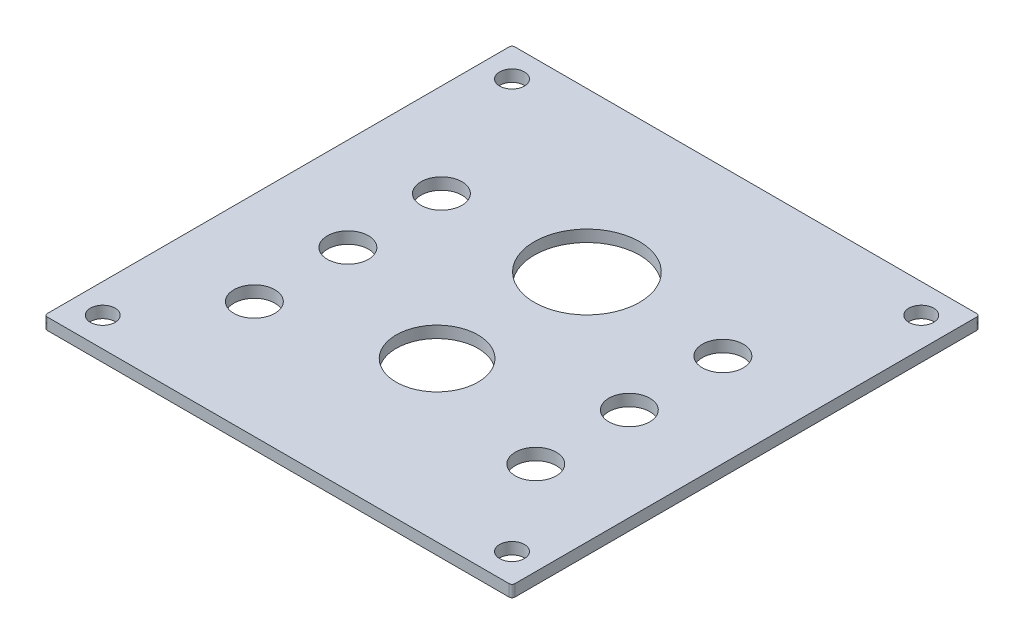
ISO-10303-21;
HEADER;
FILE_DESCRIPTION(('STEP AP214'),'2;1');
FILE_NAME('part.step','',(''),(''),'','','');
FILE_SCHEMA(('AUTOMOTIVE_DESIGN { 1 0 10303 214 1 1 1 1 }'));
ENDSEC;
DATA;
#1=APPLICATION_CONTEXT('core data for automotive mechanical design processes');
#2=APPLICATION_PROTOCOL_DEFINITION('international standard','automotive_design',2000,#1);
#3=PRODUCT_CONTEXT('',#1,'mechanical');
#4=PRODUCT('Part','Part','',(#3));
#5=PRODUCT_RELATED_PRODUCT_CATEGORY('part','',(#4));
#6=PRODUCT_DEFINITION_FORMATION('','',#4);
#7=PRODUCT_DEFINITION_CONTEXT('part definition',#1,'design');
#8=PRODUCT_DEFINITION('design','',#6,#7);
#9=PRODUCT_DEFINITION_SHAPE('','',#8);
#10=(LENGTH_UNIT() NAMED_UNIT(*) SI_UNIT(.MILLI.,.METRE.));
#11=(NAMED_UNIT(*) PLANE_ANGLE_UNIT() SI_UNIT($,.RADIAN.));
#12=(NAMED_UNIT(*) SI_UNIT($,.STERADIAN.) SOLID_ANGLE_UNIT());
#13=UNCERTAINTY_MEASURE_WITH_UNIT(LENGTH_MEASURE(1.E-05),#10,'distance_accuracy_value','');
#14=(GEOMETRIC_REPRESENTATION_CONTEXT(3) GLOBAL_UNCERTAINTY_ASSIGNED_CONTEXT((#13)) GLOBAL_UNIT_ASSIGNED_CONTEXT((#10,
#11,#12)) REPRESENTATION_CONTEXT('',''));
#15=CARTESIAN_POINT('',(0.,0.,0.));
#16=DIRECTION('',(0.,0.,1.));
#17=DIRECTION('',(1.,0.,0.));
#18=AXIS2_PLACEMENT_3D('',#15,#16,#17);
#19=CARTESIAN_POINT('',(76.3793482367759,0.,47.8960232997481));
#20=DIRECTION('',(0.,-1.,0.));
#21=DIRECTION('',(0.,0.,-1.));
#22=AXIS2_PLACEMENT_3D('',#19,#20,#21);
#23=CYLINDRICAL_SURFACE('',#22,0.793749999999989);
#24=CARTESIAN_POINT('',(76.3793482367759,0.,47.8960232997481));
#25=DIRECTION('',(0.,-1.,0.));
#26=DIRECTION('',(0.,0.,-1.));
#27=AXIS2_PLACEMENT_3D('',#24,#25,#26);
#28=CIRCLE('',#27,0.793749999999989);
#29=CARTESIAN_POINT('',(77.1730982367758,0.,47.8960232997481));
#30=VERTEX_POINT('',#29);
#31=CARTESIAN_POINT('',(76.3793482367759,0.,48.6897732997481));
#32=VERTEX_POINT('',#31);
#33=EDGE_CURVE('E92',#30,#32,#28,.T.);
#34=ORIENTED_EDGE('',*,*,#33,.T.);
#35=DIRECTION('',(0.,1.,0.));
#36=VECTOR('',#35,1.);
#37=CARTESIAN_POINT('',(76.3793482367759,0.,48.6897732997481));
#38=LINE('',#37,#36);
#39=CARTESIAN_POINT('',(76.3793482367759,-3.175,48.6897732997481));
#40=VERTEX_POINT('',#39);
#41=EDGE_CURVE('E127',#40,#32,#38,.T.);
#42=ORIENTED_EDGE('',*,*,#41,.F.);
#43=CARTESIAN_POINT('',(76.3793482367759,-3.175,47.8960232997481));
#44=DIRECTION('',(0.,-1.,0.));
#45=DIRECTION('',(0.,0.,-1.));
#46=AXIS2_PLACEMENT_3D('',#43,#44,#45);
#47=CIRCLE('',#46,0.793749999999989);
#48=CARTESIAN_POINT('',(77.1730982367758,-3.175,47.8960232997481));
#49=VERTEX_POINT('',#48);
#50=EDGE_CURVE('E27',#40,#49,#47,.F.);
#51=ORIENTED_EDGE('',*,*,#50,.T.);
#52=DIRECTION('',(0.,1.,0.));
#53=VECTOR('',#52,1.);
#54=CARTESIAN_POINT('',(77.1730982367758,0.,47.8960232997481));
#55=LINE('',#54,#53);
#56=EDGE_CURVE('E113',#30,#49,#55,.F.);
#57=ORIENTED_EDGE('',*,*,#56,.F.);
#58=EDGE_LOOP('',(#34,#42,#51,#57));
#59=FACE_BOUND('',#58,.T.);
#60=ADVANCED_FACE('F24',(#59),#23,.T.);
#61=CARTESIAN_POINT('',(-49.0331517632242,0.,47.8960232997481));
#62=DIRECTION('',(0.,-1.,0.));
#63=DIRECTION('',(0.,0.,-1.));
#64=AXIS2_PLACEMENT_3D('',#61,#62,#63);
#65=CYLINDRICAL_SURFACE('',#64,0.79375000000001);
#66=CARTESIAN_POINT('',(-49.0331517632242,0.,47.8960232997481));
#67=DIRECTION('',(0.,-1.,0.));
#68=DIRECTION('',(0.,0.,-1.));
#69=AXIS2_PLACEMENT_3D('',#66,#67,#68);
#70=CIRCLE('',#69,0.79375000000001);
#71=CARTESIAN_POINT('',(-49.0331517632242,0.,48.6897732997481));
#72=VERTEX_POINT('',#71);
#73=CARTESIAN_POINT('',(-49.8269017632242,0.,47.8960232997481));
#74=VERTEX_POINT('',#73);
#75=EDGE_CURVE('E209',#72,#74,#70,.T.);
#76=ORIENTED_EDGE('',*,*,#75,.T.);
#77=DIRECTION('',(0.,1.,0.));
#78=VECTOR('',#77,1.);
#79=CARTESIAN_POINT('',(-49.8269017632242,0.,47.8960232997481));
#80=LINE('',#79,#78);
#81=CARTESIAN_POINT('',(-49.8269017632242,-3.175,47.8960232997481));
#82=VERTEX_POINT('',#81);
#83=EDGE_CURVE('E135',#82,#74,#80,.T.);
#84=ORIENTED_EDGE('',*,*,#83,.F.);
#85=CARTESIAN_POINT('',(-49.0331517632242,-3.175,47.8960232997481));
#86=DIRECTION('',(0.,-1.,0.));
#87=DIRECTION('',(0.,0.,-1.));
#88=AXIS2_PLACEMENT_3D('',#85,#86,#87);
#89=CIRCLE('',#88,0.79375000000001);
#90=CARTESIAN_POINT('',(-49.0331517632242,-3.175,48.6897732997481));
#91=VERTEX_POINT('',#90);
#92=EDGE_CURVE('E212',#82,#91,#89,.F.);
#93=ORIENTED_EDGE('',*,*,#92,.T.);
#94=DIRECTION('',(0.,1.,0.));
#95=VECTOR('',#94,1.);
#96=CARTESIAN_POINT('',(-49.0331517632242,0.,48.6897732997481));
#97=LINE('',#96,#95);
#98=EDGE_CURVE('E124',#72,#91,#97,.F.);
#99=ORIENTED_EDGE('',*,*,#98,.F.);
#100=EDGE_LOOP('',(#76,#84,#93,#99));
#101=FACE_BOUND('',#100,.T.);
#102=ADVANCED_FACE('F217',(#101),#65,.T.);
#103=CARTESIAN_POINT('',(-49.0331517632242,0.,-77.5164767002519));
#104=DIRECTION('',(0.,-1.,0.));
#105=DIRECTION('',(0.,0.,-1.));
#106=AXIS2_PLACEMENT_3D('',#103,#104,#105);
#107=CYLINDRICAL_SURFACE('',#106,0.793749999999996);
#108=CARTESIAN_POINT('',(-49.0331517632242,0.,-77.5164767002519));
#109=DIRECTION('',(0.,-1.,0.));
#110=DIRECTION('',(0.,0.,-1.));
#111=AXIS2_PLACEMENT_3D('',#108,#109,#110);
#112=CIRCLE('',#111,0.793749999999996);
#113=CARTESIAN_POINT('',(-49.8269017632242,0.,-77.5164767002519));
#114=VERTEX_POINT('',#113);
#115=CARTESIAN_POINT('',(-49.0331517632242,0.,-78.3102267002519));
#116=VERTEX_POINT('',#115);
#117=EDGE_CURVE('E207',#114,#116,#112,.T.);
#118=ORIENTED_EDGE('',*,*,#117,.T.);
#119=DIRECTION('',(0.,1.,0.));
#120=VECTOR('',#119,1.);
#121=CARTESIAN_POINT('',(-49.0331517632242,0.,-78.3102267002519));
#122=LINE('',#121,#120);
#123=CARTESIAN_POINT('',(-49.0331517632242,-3.175,-78.3102267002519));
#124=VERTEX_POINT('',#123);
#125=EDGE_CURVE('E130',#124,#116,#122,.T.);
#126=ORIENTED_EDGE('',*,*,#125,.F.);
#127=CARTESIAN_POINT('',(-49.0331517632242,-3.175,-77.5164767002519));
#128=DIRECTION('',(0.,-1.,0.));
#129=DIRECTION('',(0.,0.,-1.));
#130=AXIS2_PLACEMENT_3D('',#127,#128,#129);
#131=CIRCLE('',#130,0.793749999999996);
#132=CARTESIAN_POINT('',(-49.8269017632242,-3.175,-77.5164767002519));
#133=VERTEX_POINT('',#132);
#134=EDGE_CURVE('E41',#124,#133,#131,.F.);
#135=ORIENTED_EDGE('',*,*,#134,.T.);
#136=DIRECTION('',(0.,1.,0.));
#137=VECTOR('',#136,1.);
#138=CARTESIAN_POINT('',(-49.8269017632242,0.,-77.5164767002519));
#139=LINE('',#138,#137);
#140=EDGE_CURVE('E134',#114,#133,#139,.F.);
#141=ORIENTED_EDGE('',*,*,#140,.F.);
#142=EDGE_LOOP('',(#118,#126,#135,#141));
#143=FACE_BOUND('',#142,.T.);
#144=ADVANCED_FACE('F241',(#143),#107,.T.);
#145=CARTESIAN_POINT('',(76.3793482367759,0.,-77.5164767002519));
#146=DIRECTION('',(0.,-1.,0.));
#147=DIRECTION('',(0.,0.,-1.));
#148=AXIS2_PLACEMENT_3D('',#145,#146,#147);
#149=PLANE('',#148);
#150=DIRECTION('',(-1.,0.,0.));
#151=VECTOR('',#150,1.);
#152=CARTESIAN_POINT('',(-49.0331517632242,0.,-78.3102267002519));
#153=LINE('',#152,#151);
#154=CARTESIAN_POINT('',(76.3793482367759,0.,-78.3102267002519));
#155=VERTEX_POINT('',#154);
#156=EDGE_CURVE('E128',#116,#155,#153,.F.);
#157=ORIENTED_EDGE('',*,*,#156,.F.);
#158=ORIENTED_EDGE('',*,*,#117,.F.);
#159=DIRECTION('',(0.,0.,1.));
#160=VECTOR('',#159,1.);
#161=CARTESIAN_POINT('',(-49.8269017632242,0.,47.8960232997481));
#162=LINE('',#161,#160);
#163=EDGE_CURVE('E131',#74,#114,#162,.F.);
#164=ORIENTED_EDGE('',*,*,#163,.F.);
#165=ORIENTED_EDGE('',*,*,#75,.F.);
#166=DIRECTION('',(1.,0.,0.));
#167=VECTOR('',#166,1.);
#168=CARTESIAN_POINT('',(76.3793482367759,0.,48.6897732997481));
#169=LINE('',#168,#167);
#170=EDGE_CURVE('E136',#32,#72,#169,.F.);
#171=ORIENTED_EDGE('',*,*,#170,.F.);
#172=ORIENTED_EDGE('',*,*,#33,.F.);
#173=DIRECTION('',(0.,0.,-1.));
#174=VECTOR('',#173,1.);
#175=CARTESIAN_POINT('',(77.1730982367758,0.,-77.5164767002519));
#176=LINE('',#175,#174);
#177=CARTESIAN_POINT('',(77.1730982367758,0.,-77.5164767002519));
#178=VERTEX_POINT('',#177);
#179=EDGE_CURVE('E109',#178,#30,#176,.F.);
#180=ORIENTED_EDGE('',*,*,#179,.F.);
#181=CARTESIAN_POINT('',(76.3793482367759,0.,-77.5164767002519));
#182=DIRECTION('',(0.,-1.,0.));
#183=DIRECTION('',(0.,0.,-1.));
#184=AXIS2_PLACEMENT_3D('',#181,#182,#183);
#185=CIRCLE('',#184,0.793749999999996);
#186=EDGE_CURVE('E97',#155,#178,#185,.T.);
#187=ORIENTED_EDGE('',*,*,#186,.F.);
#188=EDGE_LOOP('',(#157,#158,#164,#165,#171,#172,#180,#187));
#189=FACE_BOUND('',#188,.T.);
#190=CARTESIAN_POINT('',(-24.5351467305084,0.,-33.8602267002519));
#191=DIRECTION('',(0.,-1.,0.));
#192=DIRECTION('',(0.,0.,-1.));
#193=AXIS2_PLACEMENT_3D('',#190,#191,#192);
#194=CIRCLE('',#193,5.5626);
#195=CARTESIAN_POINT('',(-24.5351467305084,0.,-39.4228267002519));
#196=VERTEX_POINT('',#195);
#197=EDGE_CURVE('E117',#196,#196,#194,.T.);
#198=ORIENTED_EDGE('',*,*,#197,.T.);
#199=EDGE_LOOP('',(#198));
#200=FACE_BOUND('',#199,.T.);
#201=CARTESIAN_POINT('',(51.88134320406,0.,16.9397732997481));
#202=DIRECTION('',(0.,-1.,0.));
#203=DIRECTION('',(0.,0.,-1.));
#204=AXIS2_PLACEMENT_3D('',#201,#202,#203);
#205=CIRCLE('',#204,5.5626);
#206=CARTESIAN_POINT('',(51.88134320406,0.,11.3771732997481));
#207=VERTEX_POINT('',#206);
#208=EDGE_CURVE('E120',#207,#207,#205,.T.);
#209=ORIENTED_EDGE('',*,*,#208,.T.);
#210=EDGE_LOOP('',(#209));
#211=FACE_BOUND('',#210,.T.);
#212=CARTESIAN_POINT('',(-24.5351467305084,0.,-8.4602267002519));
#213=DIRECTION('',(0.,-1.,0.));
#214=DIRECTION('',(0.,0.,-1.));
#215=AXIS2_PLACEMENT_3D('',#212,#213,#214);
#216=CIRCLE('',#215,5.5626);
#217=CARTESIAN_POINT('',(-24.5351467305084,0.,-14.0228267002519));
#218=VERTEX_POINT('',#217);
#219=EDGE_CURVE('E177',#218,#218,#216,.T.);
#220=ORIENTED_EDGE('',*,*,#219,.T.);
#221=EDGE_LOOP('',(#220));
#222=FACE_BOUND('',#221,.T.);
#223=CARTESIAN_POINT('',(13.6730982367758,0.,-35.1556267002519));
#224=DIRECTION('',(0.,-1.,0.));
#225=DIRECTION('',(0.,0.,-1.));
#226=AXIS2_PLACEMENT_3D('',#223,#224,#225);
#227=CIRCLE('',#226,14.2875);
#228=CARTESIAN_POINT('',(13.6730982367758,0.,-49.4431267002519));
#229=VERTEX_POINT('',#228);
#230=EDGE_CURVE('E180',#229,#229,#227,.T.);
#231=ORIENTED_EDGE('',*,*,#230,.T.);
#232=EDGE_LOOP('',(#231));
#233=FACE_BOUND('',#232,.T.);
#234=CARTESIAN_POINT('',(-41.8894017632242,0.,-70.3727267002519));
#235=DIRECTION('',(0.,-1.,0.));
#236=DIRECTION('',(0.,0.,-1.));
#237=AXIS2_PLACEMENT_3D('',#234,#235,#236);
#238=CIRCLE('',#237,3.3528);
#239=CARTESIAN_POINT('',(-41.8894017632242,0.,-73.7255267002519));
#240=VERTEX_POINT('',#239);
#241=EDGE_CURVE('E183',#240,#240,#238,.T.);
#242=ORIENTED_EDGE('',*,*,#241,.T.);
#243=EDGE_LOOP('',(#242));
#244=FACE_BOUND('',#243,.T.);
#245=CARTESIAN_POINT('',(69.2355982367758,0.,40.7522732997481));
#246=DIRECTION('',(0.,-1.,0.));
#247=DIRECTION('',(0.,0.,-1.));
#248=AXIS2_PLACEMENT_3D('',#245,#246,#247);
#249=CIRCLE('',#248,3.3528);
#250=CARTESIAN_POINT('',(69.2355982367758,0.,37.3994732997481));
#251=VERTEX_POINT('',#250);
#252=EDGE_CURVE('E186',#251,#251,#249,.T.);
#253=ORIENTED_EDGE('',*,*,#252,.T.);
#254=EDGE_LOOP('',(#253));
#255=FACE_BOUND('',#254,.T.);
#256=CARTESIAN_POINT('',(69.2355982367759,0.,-70.3727267002519));
#257=DIRECTION('',(0.,-1.,0.));
#258=DIRECTION('',(0.,0.,-1.));
#259=AXIS2_PLACEMENT_3D('',#256,#257,#258);
#260=CIRCLE('',#259,3.3528);
#261=CARTESIAN_POINT('',(69.2355982367759,0.,-73.7255267002519));
#262=VERTEX_POINT('',#261);
#263=EDGE_CURVE('E189',#262,#262,#260,.T.);
#264=ORIENTED_EDGE('',*,*,#263,.T.);
#265=EDGE_LOOP('',(#264));
#266=FACE_BOUND('',#265,.T.);
#267=CARTESIAN_POINT('',(13.6730982367758,0.,5.53517329974811));
#268=DIRECTION('',(0.,-1.,0.));
#269=DIRECTION('',(0.,0.,-1.));
#270=AXIS2_PLACEMENT_3D('',#267,#268,#269);
#271=CIRCLE('',#270,11.1125);
#272=CARTESIAN_POINT('',(13.6730982367758,0.,-5.57732670025189));
#273=VERTEX_POINT('',#272);
#274=EDGE_CURVE('E192',#273,#273,#271,.T.);
#275=ORIENTED_EDGE('',*,*,#274,.T.);
#276=EDGE_LOOP('',(#275));
#277=FACE_BOUND('',#276,.T.);
#278=CARTESIAN_POINT('',(-41.8894017632242,0.,40.7522732997481));
#279=DIRECTION('',(0.,-1.,0.));
#280=DIRECTION('',(0.,0.,-1.));
#281=AXIS2_PLACEMENT_3D('',#278,#279,#280);
#282=CIRCLE('',#281,3.3528);
#283=CARTESIAN_POINT('',(-41.8894017632242,0.,37.3994732997481));
#284=VERTEX_POINT('',#283);
#285=EDGE_CURVE('E195',#284,#284,#282,.T.);
#286=ORIENTED_EDGE('',*,*,#285,.T.);
#287=EDGE_LOOP('',(#286));
#288=FACE_BOUND('',#287,.T.);
#289=CARTESIAN_POINT('',(-24.5351467305084,0.,16.9397732997481));
#290=DIRECTION('',(0.,-1.,0.));
#291=DIRECTION('',(0.,0.,-1.));
#292=AXIS2_PLACEMENT_3D('',#289,#290,#291);
#293=CIRCLE('',#292,5.5626);
#294=CARTESIAN_POINT('',(-24.5351467305084,0.,11.3771732997481));
#295=VERTEX_POINT('',#294);
#296=EDGE_CURVE('E198',#295,#295,#293,.T.);
#297=ORIENTED_EDGE('',*,*,#296,.T.);
#298=EDGE_LOOP('',(#297));
#299=FACE_BOUND('',#298,.T.);
#300=CARTESIAN_POINT('',(51.8813432040601,0.,-33.8602267002519));
#301=DIRECTION('',(0.,-1.,0.));
#302=DIRECTION('',(0.,0.,-1.));
#303=AXIS2_PLACEMENT_3D('',#300,#301,#302);
#304=CIRCLE('',#303,5.5626);
#305=CARTESIAN_POINT('',(51.8813432040601,0.,-39.4228267002519));
#306=VERTEX_POINT('',#305);
#307=EDGE_CURVE('E201',#306,#306,#304,.T.);
#308=ORIENTED_EDGE('',*,*,#307,.T.);
#309=EDGE_LOOP('',(#308));
#310=FACE_BOUND('',#309,.T.);
#311=CARTESIAN_POINT('',(51.8813432040601,0.,-8.4602267002519));
#312=DIRECTION('',(0.,-1.,0.));
#313=DIRECTION('',(0.,0.,-1.));
#314=AXIS2_PLACEMENT_3D('',#311,#312,#313);
#315=CIRCLE('',#314,5.5626);
#316=CARTESIAN_POINT('',(51.8813432040601,0.,-14.0228267002519));
#317=VERTEX_POINT('',#316);
#318=EDGE_CURVE('E106',#317,#317,#315,.T.);
#319=ORIENTED_EDGE('',*,*,#318,.T.);
#320=EDGE_LOOP('',(#319));
#321=FACE_BOUND('',#320,.T.);
#322=ADVANCED_FACE('F110',(#189,#200,#211,#222,#233,#244,#255,#266,#277,#288,#299,#310,#321),
#149,.F.);
#323=CARTESIAN_POINT('',(76.3793482367759,0.,-77.5164767002519));
#324=DIRECTION('',(0.,-1.,0.));
#325=DIRECTION('',(0.,0.,-1.));
#326=AXIS2_PLACEMENT_3D('',#323,#324,#325);
#327=CYLINDRICAL_SURFACE('',#326,0.793749999999996);
#328=ORIENTED_EDGE('',*,*,#186,.T.);
#329=DIRECTION('',(0.,1.,0.));
#330=VECTOR('',#329,1.);
#331=CARTESIAN_POINT('',(77.1730982367758,0.,-77.5164767002519));
#332=LINE('',#331,#330);
#333=CARTESIAN_POINT('',(77.1730982367758,-3.175,-77.5164767002519));
#334=VERTEX_POINT('',#333);
#335=EDGE_CURVE('E100',#334,#178,#332,.T.);
#336=ORIENTED_EDGE('',*,*,#335,.F.);
#337=CARTESIAN_POINT('',(76.3793482367759,-3.175,-77.5164767002519));
#338=DIRECTION('',(0.,-1.,0.));
#339=DIRECTION('',(0.,0.,-1.));
#340=AXIS2_PLACEMENT_3D('',#337,#338,#339);
#341=CIRCLE('',#340,0.793749999999996);
#342=CARTESIAN_POINT('',(76.3793482367759,-3.175,-78.3102267002519));
#343=VERTEX_POINT('',#342);
#344=EDGE_CURVE('E67',#334,#343,#341,.F.);
#345=ORIENTED_EDGE('',*,*,#344,.T.);
#346=DIRECTION('',(0.,1.,0.));
#347=VECTOR('',#346,1.);
#348=CARTESIAN_POINT('',(76.3793482367759,0.,-78.3102267002519));
#349=LINE('',#348,#347);
#350=EDGE_CURVE('E103',#155,#343,#349,.F.);
#351=ORIENTED_EDGE('',*,*,#350,.F.);
#352=EDGE_LOOP('',(#328,#336,#345,#351));
#353=FACE_BOUND('',#352,.T.);
#354=ADVANCED_FACE('F98',(#353),#327,.T.);
#355=CARTESIAN_POINT('',(51.8813432040601,0.,-8.4602267002519));
#356=DIRECTION('',(0.,-1.,0.));
#357=DIRECTION('',(0.,0.,-1.));
#358=AXIS2_PLACEMENT_3D('',#355,#356,#357);
#359=CYLINDRICAL_SURFACE('',#358,5.5626);
#360=CARTESIAN_POINT('',(51.8813432040601,-3.175,-8.4602267002519));
#361=DIRECTION('',(0.,-1.,0.));
#362=DIRECTION('',(0.,0.,-1.));
#363=AXIS2_PLACEMENT_3D('',#360,#361,#362);
#364=CIRCLE('',#363,5.5626);
#365=CARTESIAN_POINT('',(51.8813432040601,-3.175,-14.0228267002519));
#366=VERTEX_POINT('',#365);
#367=EDGE_CURVE('E172',#366,#366,#364,.F.);
#368=ORIENTED_EDGE('',*,*,#367,.F.);
#369=EDGE_LOOP('',(#368));
#370=FACE_BOUND('',#369,.T.);
#371=ORIENTED_EDGE('',*,*,#318,.F.);
#372=EDGE_LOOP('',(#371));
#373=FACE_BOUND('',#372,.T.);
#374=ADVANCED_FACE('F302',(#370,#373),#359,.F.);
#375=CARTESIAN_POINT('',(51.8813432040601,0.,-33.8602267002519));
#376=DIRECTION('',(0.,-1.,0.));
#377=DIRECTION('',(0.,0.,-1.));
#378=AXIS2_PLACEMENT_3D('',#375,#376,#377);
#379=CYLINDRICAL_SURFACE('',#378,5.5626);
#380=CARTESIAN_POINT('',(51.8813432040601,-3.175,-33.8602267002519));
#381=DIRECTION('',(0.,-1.,0.));
#382=DIRECTION('',(0.,0.,-1.));
#383=AXIS2_PLACEMENT_3D('',#380,#381,#382);
#384=CIRCLE('',#383,5.5626);
#385=CARTESIAN_POINT('',(51.8813432040601,-3.175,-39.4228267002519));
#386=VERTEX_POINT('',#385);
#387=EDGE_CURVE('E169',#386,#386,#384,.F.);
#388=ORIENTED_EDGE('',*,*,#387,.F.);
#389=EDGE_LOOP('',(#388));
#390=FACE_BOUND('',#389,.T.);
#391=ORIENTED_EDGE('',*,*,#307,.F.);
#392=EDGE_LOOP('',(#391));
#393=FACE_BOUND('',#392,.T.);
#394=ADVANCED_FACE('F298',(#390,#393),#379,.F.);
#395=CARTESIAN_POINT('',(-24.5351467305084,0.,16.9397732997481));
#396=DIRECTION('',(0.,-1.,0.));
#397=DIRECTION('',(0.,0.,-1.));
#398=AXIS2_PLACEMENT_3D('',#395,#396,#397);
#399=CYLINDRICAL_SURFACE('',#398,5.5626);
#400=CARTESIAN_POINT('',(-24.5351467305084,-3.175,16.9397732997481));
#401=DIRECTION('',(0.,-1.,0.));
#402=DIRECTION('',(0.,0.,-1.));
#403=AXIS2_PLACEMENT_3D('',#400,#401,#402);
#404=CIRCLE('',#403,5.5626);
#405=CARTESIAN_POINT('',(-24.5351467305084,-3.175,11.3771732997481));
#406=VERTEX_POINT('',#405);
#407=EDGE_CURVE('E166',#406,#406,#404,.F.);
#408=ORIENTED_EDGE('',*,*,#407,.F.);
#409=EDGE_LOOP('',(#408));
#410=FACE_BOUND('',#409,.T.);
#411=ORIENTED_EDGE('',*,*,#296,.F.);
#412=EDGE_LOOP('',(#411));
#413=FACE_BOUND('',#412,.T.);
#414=ADVANCED_FACE('F294',(#410,#413),#399,.F.);
#415=CARTESIAN_POINT('',(-41.8894017632242,0.,40.7522732997481));
#416=DIRECTION('',(0.,-1.,0.));
#417=DIRECTION('',(0.,0.,-1.));
#418=AXIS2_PLACEMENT_3D('',#415,#416,#417);
#419=CYLINDRICAL_SURFACE('',#418,3.3528);
#420=CARTESIAN_POINT('',(-41.8894017632242,-3.175,40.7522732997481));
#421=DIRECTION('',(0.,-1.,0.));
#422=DIRECTION('',(0.,0.,-1.));
#423=AXIS2_PLACEMENT_3D('',#420,#421,#422);
#424=CIRCLE('',#423,3.3528);
#425=CARTESIAN_POINT('',(-41.8894017632242,-3.175,37.3994732997481));
#426=VERTEX_POINT('',#425);
#427=EDGE_CURVE('E163',#426,#426,#424,.F.);
#428=ORIENTED_EDGE('',*,*,#427,.F.);
#429=EDGE_LOOP('',(#428));
#430=FACE_BOUND('',#429,.T.);
#431=ORIENTED_EDGE('',*,*,#285,.F.);
#432=EDGE_LOOP('',(#431));
#433=FACE_BOUND('',#432,.T.);
#434=ADVANCED_FACE('F290',(#430,#433),#419,.F.);
#435=CARTESIAN_POINT('',(13.6730982367758,0.,5.53517329974811));
#436=DIRECTION('',(0.,-1.,0.));
#437=DIRECTION('',(0.,0.,-1.));
#438=AXIS2_PLACEMENT_3D('',#435,#436,#437);
#439=CYLINDRICAL_SURFACE('',#438,11.1125);
#440=CARTESIAN_POINT('',(13.6730982367758,-3.175,5.53517329974811));
#441=DIRECTION('',(0.,-1.,0.));
#442=DIRECTION('',(0.,0.,-1.));
#443=AXIS2_PLACEMENT_3D('',#440,#441,#442);
#444=CIRCLE('',#443,11.1125);
#445=CARTESIAN_POINT('',(13.6730982367758,-3.175,-5.57732670025189));
#446=VERTEX_POINT('',#445);
#447=EDGE_CURVE('E160',#446,#446,#444,.F.);
#448=ORIENTED_EDGE('',*,*,#447,.F.);
#449=EDGE_LOOP('',(#448));
#450=FACE_BOUND('',#449,.T.);
#451=ORIENTED_EDGE('',*,*,#274,.F.);
#452=EDGE_LOOP('',(#451));
#453=FACE_BOUND('',#452,.T.);
#454=ADVANCED_FACE('F286',(#450,#453),#439,.F.);
#455=CARTESIAN_POINT('',(69.2355982367759,0.,-70.3727267002519));
#456=DIRECTION('',(0.,-1.,0.));
#457=DIRECTION('',(0.,0.,-1.));
#458=AXIS2_PLACEMENT_3D('',#455,#456,#457);
#459=CYLINDRICAL_SURFACE('',#458,3.3528);
#460=CARTESIAN_POINT('',(69.2355982367759,-3.175,-70.3727267002519));
#461=DIRECTION('',(0.,-1.,0.));
#462=DIRECTION('',(0.,0.,-1.));
#463=AXIS2_PLACEMENT_3D('',#460,#461,#462);
#464=CIRCLE('',#463,3.3528);
#465=CARTESIAN_POINT('',(69.2355982367759,-3.175,-73.7255267002519));
#466=VERTEX_POINT('',#465);
#467=EDGE_CURVE('E157',#466,#466,#464,.F.);
#468=ORIENTED_EDGE('',*,*,#467,.F.);
#469=EDGE_LOOP('',(#468));
#470=FACE_BOUND('',#469,.T.);
#471=ORIENTED_EDGE('',*,*,#263,.F.);
#472=EDGE_LOOP('',(#471));
#473=FACE_BOUND('',#472,.T.);
#474=ADVANCED_FACE('F282',(#470,#473),#459,.F.);
#475=CARTESIAN_POINT('',(69.2355982367758,0.,40.7522732997481));
#476=DIRECTION('',(0.,-1.,0.));
#477=DIRECTION('',(0.,0.,-1.));
#478=AXIS2_PLACEMENT_3D('',#475,#476,#477);
#479=CYLINDRICAL_SURFACE('',#478,3.3528);
#480=CARTESIAN_POINT('',(69.2355982367758,-3.175,40.7522732997481));
#481=DIRECTION('',(0.,-1.,0.));
#482=DIRECTION('',(0.,0.,-1.));
#483=AXIS2_PLACEMENT_3D('',#480,#481,#482);
#484=CIRCLE('',#483,3.3528);
#485=CARTESIAN_POINT('',(69.2355982367758,-3.175,37.3994732997481));
#486=VERTEX_POINT('',#485);
#487=EDGE_CURVE('E154',#486,#486,#484,.F.);
#488=ORIENTED_EDGE('',*,*,#487,.F.);
#489=EDGE_LOOP('',(#488));
#490=FACE_BOUND('',#489,.T.);
#491=ORIENTED_EDGE('',*,*,#252,.F.);
#492=EDGE_LOOP('',(#491));
#493=FACE_BOUND('',#492,.T.);
#494=ADVANCED_FACE('F278',(#490,#493),#479,.F.);
#495=CARTESIAN_POINT('',(-41.8894017632242,0.,-70.3727267002519));
#496=DIRECTION('',(0.,-1.,0.));
#497=DIRECTION('',(0.,0.,-1.));
#498=AXIS2_PLACEMENT_3D('',#495,#496,#497);
#499=CYLINDRICAL_SURFACE('',#498,3.3528);
#500=CARTESIAN_POINT('',(-41.8894017632242,-3.175,-70.3727267002519));
#501=DIRECTION('',(0.,-1.,0.));
#502=DIRECTION('',(0.,0.,-1.));
#503=AXIS2_PLACEMENT_3D('',#500,#501,#502);
#504=CIRCLE('',#503,3.3528);
#505=CARTESIAN_POINT('',(-41.8894017632242,-3.175,-73.7255267002519));
#506=VERTEX_POINT('',#505);
#507=EDGE_CURVE('E151',#506,#506,#504,.F.);
#508=ORIENTED_EDGE('',*,*,#507,.F.);
#509=EDGE_LOOP('',(#508));
#510=FACE_BOUND('',#509,.T.);
#511=ORIENTED_EDGE('',*,*,#241,.F.);
#512=EDGE_LOOP('',(#511));
#513=FACE_BOUND('',#512,.T.);
#514=ADVANCED_FACE('F274',(#510,#513),#499,.F.);
#515=CARTESIAN_POINT('',(13.6730982367758,0.,-35.1556267002519));
#516=DIRECTION('',(0.,-1.,0.));
#517=DIRECTION('',(0.,0.,-1.));
#518=AXIS2_PLACEMENT_3D('',#515,#516,#517);
#519=CYLINDRICAL_SURFACE('',#518,14.2875);
#520=CARTESIAN_POINT('',(13.6730982367758,-3.175,-35.1556267002519));
#521=DIRECTION('',(0.,-1.,0.));
#522=DIRECTION('',(0.,0.,-1.));
#523=AXIS2_PLACEMENT_3D('',#520,#521,#522);
#524=CIRCLE('',#523,14.2875);
#525=CARTESIAN_POINT('',(13.6730982367758,-3.175,-49.4431267002519));
#526=VERTEX_POINT('',#525);
#527=EDGE_CURVE('E148',#526,#526,#524,.F.);
#528=ORIENTED_EDGE('',*,*,#527,.F.);
#529=EDGE_LOOP('',(#528));
#530=FACE_BOUND('',#529,.T.);
#531=ORIENTED_EDGE('',*,*,#230,.F.);
#532=EDGE_LOOP('',(#531));
#533=FACE_BOUND('',#532,.T.);
#534=ADVANCED_FACE('F270',(#530,#533),#519,.F.);
#535=CARTESIAN_POINT('',(-24.5351467305084,0.,-8.4602267002519));
#536=DIRECTION('',(0.,-1.,0.));
#537=DIRECTION('',(0.,0.,-1.));
#538=AXIS2_PLACEMENT_3D('',#535,#536,#537);
#539=CYLINDRICAL_SURFACE('',#538,5.5626);
#540=CARTESIAN_POINT('',(-24.5351467305084,-3.175,-8.4602267002519));
#541=DIRECTION('',(0.,-1.,0.));
#542=DIRECTION('',(0.,0.,-1.));
#543=AXIS2_PLACEMENT_3D('',#540,#541,#542);
#544=CIRCLE('',#543,5.5626);
#545=CARTESIAN_POINT('',(-24.5351467305084,-3.175,-14.0228267002519));
#546=VERTEX_POINT('',#545);
#547=EDGE_CURVE('E145',#546,#546,#544,.F.);
#548=ORIENTED_EDGE('',*,*,#547,.F.);
#549=EDGE_LOOP('',(#548));
#550=FACE_BOUND('',#549,.T.);
#551=ORIENTED_EDGE('',*,*,#219,.F.);
#552=EDGE_LOOP('',(#551));
#553=FACE_BOUND('',#552,.T.);
#554=ADVANCED_FACE('F266',(#550,#553),#539,.F.);
#555=CARTESIAN_POINT('',(51.88134320406,0.,16.9397732997481));
#556=DIRECTION('',(0.,-1.,0.));
#557=DIRECTION('',(0.,0.,-1.));
#558=AXIS2_PLACEMENT_3D('',#555,#556,#557);
#559=CYLINDRICAL_SURFACE('',#558,5.5626);
#560=CARTESIAN_POINT('',(51.88134320406,-3.175,16.9397732997481));
#561=DIRECTION('',(0.,-1.,0.));
#562=DIRECTION('',(0.,0.,-1.));
#563=AXIS2_PLACEMENT_3D('',#560,#561,#562);
#564=CIRCLE('',#563,5.5626);
#565=CARTESIAN_POINT('',(51.88134320406,-3.175,11.3771732997481));
#566=VERTEX_POINT('',#565);
#567=EDGE_CURVE('E142',#566,#566,#564,.F.);
#568=ORIENTED_EDGE('',*,*,#567,.F.);
#569=EDGE_LOOP('',(#568));
#570=FACE_BOUND('',#569,.T.);
#571=ORIENTED_EDGE('',*,*,#208,.F.);
#572=EDGE_LOOP('',(#571));
#573=FACE_BOUND('',#572,.T.);
#574=ADVANCED_FACE('F262',(#570,#573),#559,.F.);
#575=CARTESIAN_POINT('',(-24.5351467305084,0.,-33.8602267002519));
#576=DIRECTION('',(0.,-1.,0.));
#577=DIRECTION('',(0.,0.,-1.));
#578=AXIS2_PLACEMENT_3D('',#575,#576,#577);
#579=CYLINDRICAL_SURFACE('',#578,5.5626);
#580=CARTESIAN_POINT('',(-24.5351467305084,-3.175,-33.8602267002519));
#581=DIRECTION('',(0.,-1.,0.));
#582=DIRECTION('',(0.,0.,-1.));
#583=AXIS2_PLACEMENT_3D('',#580,#581,#582);
#584=CIRCLE('',#583,5.5626);
#585=CARTESIAN_POINT('',(-24.5351467305084,-3.175,-39.4228267002519));
#586=VERTEX_POINT('',#585);
#587=EDGE_CURVE('E139',#586,#586,#584,.F.);
#588=ORIENTED_EDGE('',*,*,#587,.F.);
#589=EDGE_LOOP('',(#588));
#590=FACE_BOUND('',#589,.T.);
#591=ORIENTED_EDGE('',*,*,#197,.F.);
#592=EDGE_LOOP('',(#591));
#593=FACE_BOUND('',#592,.T.);
#594=ADVANCED_FACE('F259',(#590,#593),#579,.F.);
#595=CARTESIAN_POINT('',(77.1730982367758,0.,-77.5164767002519));
#596=DIRECTION('',(1.,0.,0.));
#597=DIRECTION('',(0.,0.,-1.));
#598=AXIS2_PLACEMENT_3D('',#595,#596,#597);
#599=PLANE('',#598);
#600=ORIENTED_EDGE('',*,*,#179,.T.);
#601=ORIENTED_EDGE('',*,*,#56,.T.);
#602=DIRECTION('',(0.,0.,-1.));
#603=VECTOR('',#602,1.);
#604=CARTESIAN_POINT('',(77.1730982367758,-3.175,-77.5164767002519));
#605=LINE('',#604,#603);
#606=EDGE_CURVE('E116',#334,#49,#605,.F.);
#607=ORIENTED_EDGE('',*,*,#606,.F.);
#608=ORIENTED_EDGE('',*,*,#335,.T.);
#609=EDGE_LOOP('',(#600,#601,#607,#608));
#610=FACE_BOUND('',#609,.T.);
#611=ADVANCED_FACE('F115',(#610),#599,.T.);
#612=CARTESIAN_POINT('',(76.3793482367759,0.,48.6897732997481));
#613=DIRECTION('',(0.,0.,1.));
#614=DIRECTION('',(1.,0.,0.));
#615=AXIS2_PLACEMENT_3D('',#612,#613,#614);
#616=PLANE('',#615);
#617=ORIENTED_EDGE('',*,*,#170,.T.);
#618=ORIENTED_EDGE('',*,*,#98,.T.);
#619=DIRECTION('',(1.,0.,0.));
#620=VECTOR('',#619,1.);
#621=CARTESIAN_POINT('',(76.3793482367759,-3.175,48.6897732997481));
#622=LINE('',#621,#620);
#623=EDGE_CURVE('E224',#40,#91,#622,.F.);
#624=ORIENTED_EDGE('',*,*,#623,.F.);
#625=ORIENTED_EDGE('',*,*,#41,.T.);
#626=EDGE_LOOP('',(#617,#618,#624,#625));
#627=FACE_BOUND('',#626,.T.);
#628=ADVANCED_FACE('F222',(#627),#616,.T.);
#629=CARTESIAN_POINT('',(-49.8269017632242,0.,47.8960232997481));
#630=DIRECTION('',(-1.,0.,0.));
#631=DIRECTION('',(0.,0.,1.));
#632=AXIS2_PLACEMENT_3D('',#629,#630,#631);
#633=PLANE('',#632);
#634=ORIENTED_EDGE('',*,*,#163,.T.);
#635=ORIENTED_EDGE('',*,*,#140,.T.);
#636=DIRECTION('',(0.,0.,-1.));
#637=VECTOR('',#636,1.);
#638=CARTESIAN_POINT('',(-49.8269017632242,-3.175,-77.5164767002519));
#639=LINE('',#638,#637);
#640=EDGE_CURVE('E33',#82,#133,#639,.T.);
#641=ORIENTED_EDGE('',*,*,#640,.F.);
#642=ORIENTED_EDGE('',*,*,#83,.T.);
#643=EDGE_LOOP('',(#634,#635,#641,#642));
#644=FACE_BOUND('',#643,.T.);
#645=ADVANCED_FACE('F239',(#644),#633,.T.);
#646=CARTESIAN_POINT('',(-49.0331517632242,0.,-78.3102267002519));
#647=DIRECTION('',(0.,0.,-1.));
#648=DIRECTION('',(-1.,0.,0.));
#649=AXIS2_PLACEMENT_3D('',#646,#647,#648);
#650=PLANE('',#649);
#651=ORIENTED_EDGE('',*,*,#156,.T.);
#652=ORIENTED_EDGE('',*,*,#350,.T.);
#653=DIRECTION('',(1.,0.,0.));
#654=VECTOR('',#653,1.);
#655=CARTESIAN_POINT('',(76.3793482367759,-3.175,-78.3102267002519));
#656=LINE('',#655,#654);
#657=EDGE_CURVE('E13',#124,#343,#656,.T.);
#658=ORIENTED_EDGE('',*,*,#657,.F.);
#659=ORIENTED_EDGE('',*,*,#125,.T.);
#660=EDGE_LOOP('',(#651,#652,#658,#659));
#661=FACE_BOUND('',#660,.T.);
#662=ADVANCED_FACE('F244',(#661),#650,.T.);
#663=CARTESIAN_POINT('',(76.3793482367759,-3.175,-77.5164767002519));
#664=DIRECTION('',(0.,-1.,0.));
#665=DIRECTION('',(0.,0.,-1.));
#666=AXIS2_PLACEMENT_3D('',#663,#664,#665);
#667=PLANE('',#666);
#668=ORIENTED_EDGE('',*,*,#134,.F.);
#669=ORIENTED_EDGE('',*,*,#657,.T.);
#670=ORIENTED_EDGE('',*,*,#344,.F.);
#671=ORIENTED_EDGE('',*,*,#606,.T.);
#672=ORIENTED_EDGE('',*,*,#50,.F.);
#673=ORIENTED_EDGE('',*,*,#623,.T.);
#674=ORIENTED_EDGE('',*,*,#92,.F.);
#675=ORIENTED_EDGE('',*,*,#640,.T.);
#676=EDGE_LOOP('',(#668,#669,#670,#671,#672,#673,#674,#675));
#677=FACE_BOUND('',#676,.T.);
#678=ORIENTED_EDGE('',*,*,#587,.T.);
#679=EDGE_LOOP('',(#678));
#680=FACE_BOUND('',#679,.T.);
#681=ORIENTED_EDGE('',*,*,#567,.T.);
#682=EDGE_LOOP('',(#681));
#683=FACE_BOUND('',#682,.T.);
#684=ORIENTED_EDGE('',*,*,#547,.T.);
#685=EDGE_LOOP('',(#684));
#686=FACE_BOUND('',#685,.T.);
#687=ORIENTED_EDGE('',*,*,#527,.T.);
#688=EDGE_LOOP('',(#687));
#689=FACE_BOUND('',#688,.T.);
#690=ORIENTED_EDGE('',*,*,#507,.T.);
#691=EDGE_LOOP('',(#690));
#692=FACE_BOUND('',#691,.T.);
#693=ORIENTED_EDGE('',*,*,#487,.T.);
#694=EDGE_LOOP('',(#693));
#695=FACE_BOUND('',#694,.T.);
#696=ORIENTED_EDGE('',*,*,#467,.T.);
#697=EDGE_LOOP('',(#696));
#698=FACE_BOUND('',#697,.T.);
#699=ORIENTED_EDGE('',*,*,#447,.T.);
#700=EDGE_LOOP('',(#699));
#701=FACE_BOUND('',#700,.T.);
#702=ORIENTED_EDGE('',*,*,#427,.T.);
#703=EDGE_LOOP('',(#702));
#704=FACE_BOUND('',#703,.T.);
#705=ORIENTED_EDGE('',*,*,#407,.T.);
#706=EDGE_LOOP('',(#705));
#707=FACE_BOUND('',#706,.T.);
#708=ORIENTED_EDGE('',*,*,#387,.T.);
#709=EDGE_LOOP('',(#708));
#710=FACE_BOUND('',#709,.T.);
#711=ORIENTED_EDGE('',*,*,#367,.T.);
#712=EDGE_LOOP('',(#711));
#713=FACE_BOUND('',#712,.T.);
#714=ADVANCED_FACE('F225',(#677,#680,#683,#686,#689,#692,#695,#698,#701,#704,#707,#710,#713),
#667,.T.);
#715=CLOSED_SHELL('',(#60,#102,#144,#322,#354,#374,#394,#414,#434,#454,#474,#494,#514,#534,#554,
#574,#594,#611,#628,#645,#662,#714));
#716=MANIFOLD_SOLID_BREP('B1',#715);
#717=ADVANCED_BREP_SHAPE_REPRESENTATION('',(#18,#716),#14);
#718=SHAPE_DEFINITION_REPRESENTATION(#9,#717);
ENDSEC;
END-ISO-10303-21;
